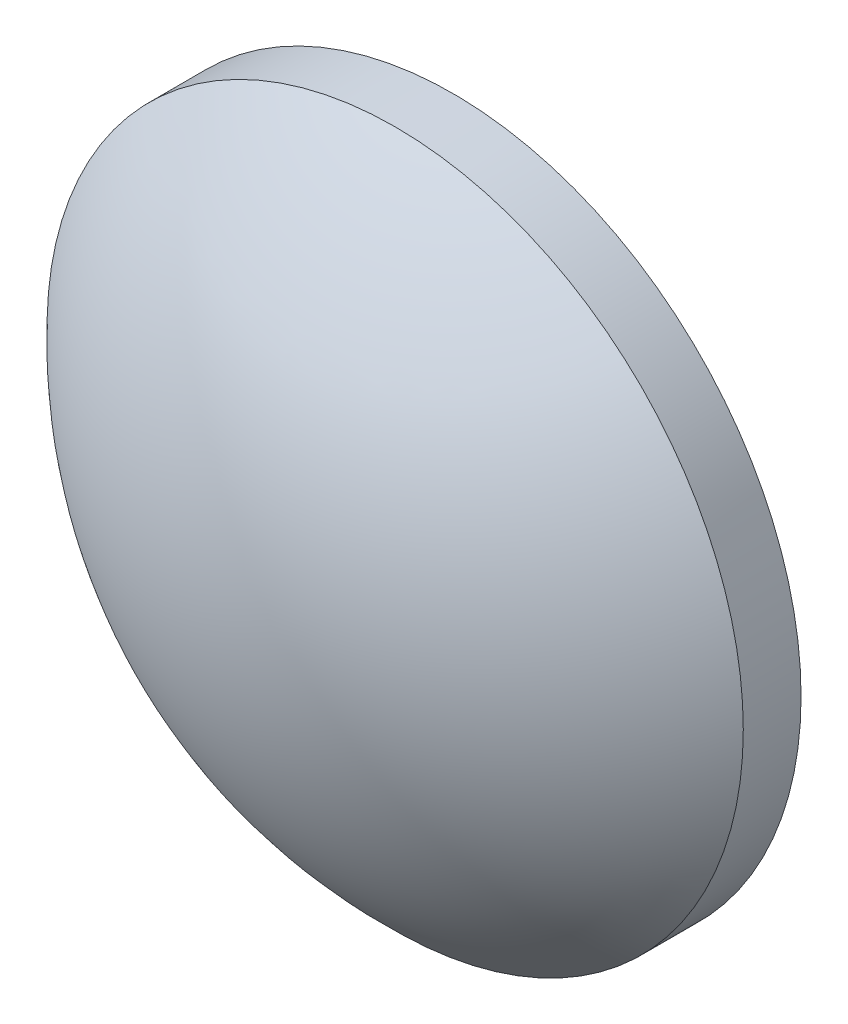
ISO-10303-21;
HEADER;
FILE_DESCRIPTION(('STEP AP214'),'2;1');
FILE_NAME('part.step','',(''),(''),'','','');
FILE_SCHEMA(('AUTOMOTIVE_DESIGN { 1 0 10303 214 1 1 1 1 }'));
ENDSEC;
DATA;
#1=APPLICATION_CONTEXT('core data for automotive mechanical design processes');
#2=APPLICATION_PROTOCOL_DEFINITION('international standard','automotive_design',2000,#1);
#3=PRODUCT_CONTEXT('',#1,'mechanical');
#4=PRODUCT('Part','Part','',(#3));
#5=PRODUCT_RELATED_PRODUCT_CATEGORY('part','',(#4));
#6=PRODUCT_DEFINITION_FORMATION('','',#4);
#7=PRODUCT_DEFINITION_CONTEXT('part definition',#1,'design');
#8=PRODUCT_DEFINITION('design','',#6,#7);
#9=PRODUCT_DEFINITION_SHAPE('','',#8);
#10=(LENGTH_UNIT() NAMED_UNIT(*) SI_UNIT(.MILLI.,.METRE.));
#11=(NAMED_UNIT(*) PLANE_ANGLE_UNIT() SI_UNIT($,.RADIAN.));
#12=(NAMED_UNIT(*) SI_UNIT($,.STERADIAN.) SOLID_ANGLE_UNIT());
#13=UNCERTAINTY_MEASURE_WITH_UNIT(LENGTH_MEASURE(1.E-05),#10,'distance_accuracy_value','');
#14=(GEOMETRIC_REPRESENTATION_CONTEXT(3) GLOBAL_UNCERTAINTY_ASSIGNED_CONTEXT((#13)) GLOBAL_UNIT_ASSIGNED_CONTEXT((#10,
#11,#12)) REPRESENTATION_CONTEXT('',''));
#15=CARTESIAN_POINT('',(0.,0.,0.));
#16=DIRECTION('',(0.,0.,1.));
#17=DIRECTION('',(1.,0.,0.));
#18=AXIS2_PLACEMENT_3D('',#15,#16,#17);
#19=CARTESIAN_POINT('',(0.,0.,-16.115));
#20=DIRECTION('',(0.,0.,1.));
#21=DIRECTION('',(0.,1.,0.));
#22=AXIS2_PLACEMENT_3D('',#19,#20,#21);
#23=SPHERICAL_SURFACE('',#22,20.6);
#24=CARTESIAN_POINT('',(0.,0.,-1.99550992422177));
#25=DIRECTION('',(0.,0.,1.));
#26=DIRECTION('',(1.,0.,0.));
#27=AXIS2_PLACEMENT_3D('',#24,#25,#26);
#28=CIRCLE('',#27,15.);
#29=CARTESIAN_POINT('',(15.,0.,-1.99550992422177));
#30=VERTEX_POINT('',#29);
#31=EDGE_CURVE('E8',#30,#30,#28,.T.);
#32=ORIENTED_EDGE('',*,*,#31,.T.);
#33=EDGE_LOOP('',(#32));
#34=FACE_BOUND('',#33,.T.);
#35=ADVANCED_FACE('F12',(#34),#23,.T.);
#36=CARTESIAN_POINT('',(0.,0.,4.30813204540037));
#37=DIRECTION('',(0.,0.,1.));
#38=DIRECTION('',(1.,0.,0.));
#39=AXIS2_PLACEMENT_3D('',#36,#37,#38);
#40=CYLINDRICAL_SURFACE('',#39,15.);
#41=ORIENTED_EDGE('',*,*,#31,.F.);
#42=EDGE_LOOP('',(#41));
#43=FACE_BOUND('',#42,.T.);
#44=CARTESIAN_POINT('',(0.,0.,-4.485));
#45=DIRECTION('',(0.,0.,1.));
#46=DIRECTION('',(1.,0.,0.));
#47=AXIS2_PLACEMENT_3D('',#44,#45,#46);
#48=CIRCLE('',#47,15.);
#49=CARTESIAN_POINT('',(15.,0.,-4.485));
#50=VERTEX_POINT('',#49);
#51=EDGE_CURVE('E18',#50,#50,#48,.T.);
#52=ORIENTED_EDGE('',*,*,#51,.T.);
#53=EDGE_LOOP('',(#52));
#54=FACE_BOUND('',#53,.T.);
#55=ADVANCED_FACE('F24',(#43,#54),#40,.T.);
#56=CARTESIAN_POINT('',(0.,0.,-4.485));
#57=DIRECTION('',(0.,0.,1.));
#58=DIRECTION('',(1.,0.,0.));
#59=AXIS2_PLACEMENT_3D('',#56,#57,#58);
#60=PLANE('',#59);
#61=ORIENTED_EDGE('',*,*,#51,.F.);
#62=EDGE_LOOP('',(#61));
#63=FACE_BOUND('',#62,.T.);
#64=ADVANCED_FACE('F26',(#63),#60,.F.);
#65=CLOSED_SHELL('',(#35,#55,#64));
#66=MANIFOLD_SOLID_BREP('B1',#65);
#67=ADVANCED_BREP_SHAPE_REPRESENTATION('',(#18,#66),#14);
#68=SHAPE_DEFINITION_REPRESENTATION(#9,#67);
ENDSEC;
END-ISO-10303-21;
